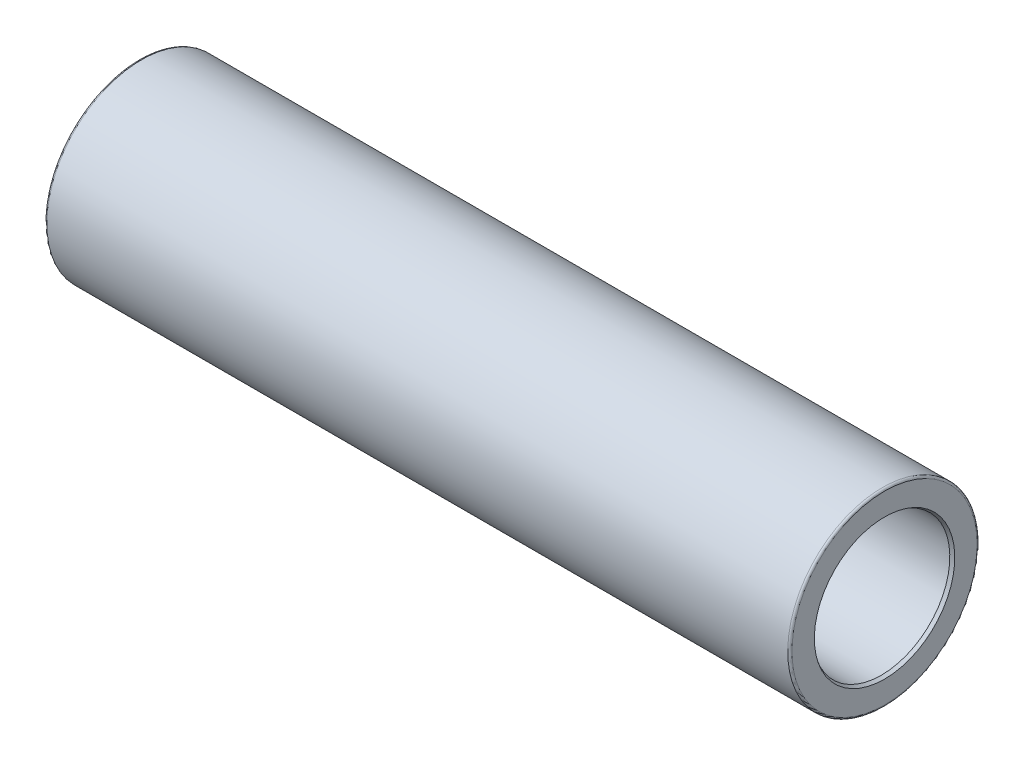
ISO-10303-21;
HEADER;
FILE_DESCRIPTION(('STEP AP214'),'2;1');
FILE_NAME('part.step','',(''),(''),'','','');
FILE_SCHEMA(('AUTOMOTIVE_DESIGN { 1 0 10303 214 1 1 1 1 }'));
ENDSEC;
DATA;
#1=APPLICATION_CONTEXT('core data for automotive mechanical design processes');
#2=APPLICATION_PROTOCOL_DEFINITION('international standard','automotive_design',2000,#1);
#3=PRODUCT_CONTEXT('',#1,'mechanical');
#4=PRODUCT('Part','Part','',(#3));
#5=PRODUCT_RELATED_PRODUCT_CATEGORY('part','',(#4));
#6=PRODUCT_DEFINITION_FORMATION('','',#4);
#7=PRODUCT_DEFINITION_CONTEXT('part definition',#1,'design');
#8=PRODUCT_DEFINITION('design','',#6,#7);
#9=PRODUCT_DEFINITION_SHAPE('','',#8);
#10=(LENGTH_UNIT() NAMED_UNIT(*) SI_UNIT(.MILLI.,.METRE.));
#11=(NAMED_UNIT(*) PLANE_ANGLE_UNIT() SI_UNIT($,.RADIAN.));
#12=(NAMED_UNIT(*) SI_UNIT($,.STERADIAN.) SOLID_ANGLE_UNIT());
#13=UNCERTAINTY_MEASURE_WITH_UNIT(LENGTH_MEASURE(1.E-05),#10,'distance_accuracy_value','');
#14=(GEOMETRIC_REPRESENTATION_CONTEXT(3) GLOBAL_UNCERTAINTY_ASSIGNED_CONTEXT((#13)) GLOBAL_UNIT_ASSIGNED_CONTEXT((#10,
#11,#12)) REPRESENTATION_CONTEXT('',''));
#15=CARTESIAN_POINT('',(0.,0.,0.));
#16=DIRECTION('',(0.,0.,1.));
#17=DIRECTION('',(1.,0.,0.));
#18=AXIS2_PLACEMENT_3D('',#15,#16,#17);
#19=CARTESIAN_POINT('',(-177.,0.,0.));
#20=DIRECTION('',(-1.,0.,0.));
#21=DIRECTION('',(0.,-1.,0.));
#22=AXIS2_PLACEMENT_3D('',#19,#20,#21);
#23=CYLINDRICAL_SURFACE('',#22,32.5);
#24=CARTESIAN_POINT('',(-120.462610505505,-2.22044604925031E-13,2.22044604925031E-13));
#25=DIRECTION('',(-1.,0.,0.));
#26=DIRECTION('',(0.,-1.,0.));
#27=AXIS2_PLACEMENT_3D('',#24,#25,#26);
#28=CIRCLE('',#27,32.5);
#29=CARTESIAN_POINT('',(-120.462610505505,-32.5000000000003,2.14828155264968E-13));
#30=VERTEX_POINT('',#29);
#31=EDGE_CURVE('E10',#30,#30,#28,.T.);
#32=ORIENTED_EDGE('',*,*,#31,.F.);
#33=EDGE_LOOP('',(#32));
#34=FACE_BOUND('',#33,.T.);
#35=CARTESIAN_POINT('',(-175.5,0.,0.));
#36=DIRECTION('',(-1.,0.,0.));
#37=DIRECTION('',(0.,-1.,0.));
#38=AXIS2_PLACEMENT_3D('',#35,#36,#37);
#39=CIRCLE('',#38,32.5);
#40=CARTESIAN_POINT('',(-175.5,-32.5,0.));
#41=VERTEX_POINT('',#40);
#42=EDGE_CURVE('E112',#41,#41,#39,.T.);
#43=ORIENTED_EDGE('',*,*,#42,.T.);
#44=EDGE_LOOP('',(#43));
#45=FACE_BOUND('',#44,.T.);
#46=ADVANCED_FACE('F39',(#34,#45),#23,.F.);
#47=CARTESIAN_POINT('',(-177.,32.4999999999999,4.44089209850063E-13));
#48=DIRECTION('',(-1.,0.,0.));
#49=DIRECTION('',(0.,-1.,0.));
#50=AXIS2_PLACEMENT_3D('',#47,#48,#49);
#51=PLANE('',#50);
#52=CARTESIAN_POINT('',(-177.,0.,0.));
#53=DIRECTION('',(-1.,0.,0.));
#54=DIRECTION('',(0.,-1.,0.));
#55=AXIS2_PLACEMENT_3D('',#52,#53,#54);
#56=CIRCLE('',#55,44.);
#57=CARTESIAN_POINT('',(-177.,-44.0000000000001,0.));
#58=VERTEX_POINT('',#57);
#59=EDGE_CURVE('E103',#58,#58,#56,.T.);
#60=ORIENTED_EDGE('',*,*,#59,.T.);
#61=EDGE_LOOP('',(#60));
#62=FACE_BOUND('',#61,.T.);
#63=CARTESIAN_POINT('',(-177.,0.,0.));
#64=DIRECTION('',(-1.,0.,0.));
#65=DIRECTION('',(0.,-1.,0.));
#66=AXIS2_PLACEMENT_3D('',#63,#64,#65);
#67=CIRCLE('',#66,33.3660254037845);
#68=CARTESIAN_POINT('',(-177.,-33.3660254037845,0.));
#69=VERTEX_POINT('',#68);
#70=EDGE_CURVE('E115',#69,#69,#67,.T.);
#71=ORIENTED_EDGE('',*,*,#70,.F.);
#72=EDGE_LOOP('',(#71));
#73=FACE_BOUND('',#72,.T.);
#74=ADVANCED_FACE('F122',(#62,#73),#51,.T.);
#75=CARTESIAN_POINT('',(-177.,0.,0.));
#76=DIRECTION('',(-1.,0.,0.));
#77=DIRECTION('',(0.,-1.,0.));
#78=AXIS2_PLACEMENT_3D('',#75,#76,#77);
#79=CYLINDRICAL_SURFACE('',#78,32.5);
#80=CARTESIAN_POINT('',(120.462610505505,-3.33066907387547E-13,2.22044604925031E-13));
#81=DIRECTION('',(-1.,0.,0.));
#82=DIRECTION('',(0.,-1.,0.));
#83=AXIS2_PLACEMENT_3D('',#80,#81,#82);
#84=CIRCLE('',#83,32.5);
#85=CARTESIAN_POINT('',(120.462610505505,-32.5000000000004,2.14828155264968E-13));
#86=VERTEX_POINT('',#85);
#87=EDGE_CURVE('E91',#86,#86,#84,.T.);
#88=ORIENTED_EDGE('',*,*,#87,.T.);
#89=EDGE_LOOP('',(#88));
#90=FACE_BOUND('',#89,.T.);
#91=CARTESIAN_POINT('',(175.5,-2.77555756156289E-13,8.88178419700125E-13));
#92=DIRECTION('',(-1.,0.,0.));
#93=DIRECTION('',(0.,-1.,0.));
#94=AXIS2_PLACEMENT_3D('',#91,#92,#93);
#95=CIRCLE('',#94,32.5000000000001);
#96=CARTESIAN_POINT('',(175.5,-32.5000000000004,8.80961970040062E-13));
#97=VERTEX_POINT('',#96);
#98=EDGE_CURVE('E106',#97,#97,#95,.T.);
#99=ORIENTED_EDGE('',*,*,#98,.F.);
#100=EDGE_LOOP('',(#99));
#101=FACE_BOUND('',#100,.T.);
#102=ADVANCED_FACE('F124',(#90,#101),#79,.F.);
#103=CARTESIAN_POINT('',(177.,32.5,1.11022302462516E-12));
#104=DIRECTION('',(-1.,0.,0.));
#105=DIRECTION('',(0.,-1.,0.));
#106=AXIS2_PLACEMENT_3D('',#103,#104,#105);
#107=PLANE('',#106);
#108=CARTESIAN_POINT('',(177.,0.,0.));
#109=DIRECTION('',(-1.,0.,0.));
#110=DIRECTION('',(0.,-1.,0.));
#111=AXIS2_PLACEMENT_3D('',#108,#109,#110);
#112=CIRCLE('',#111,44.);
#113=CARTESIAN_POINT('',(177.,-44.0000000000001,0.));
#114=VERTEX_POINT('',#113);
#115=EDGE_CURVE('E94',#114,#114,#112,.T.);
#116=ORIENTED_EDGE('',*,*,#115,.F.);
#117=EDGE_LOOP('',(#116));
#118=FACE_BOUND('',#117,.T.);
#119=CARTESIAN_POINT('',(177.,0.,1.11022302462516E-12));
#120=DIRECTION('',(-1.,0.,0.));
#121=DIRECTION('',(0.,-1.,0.));
#122=AXIS2_PLACEMENT_3D('',#119,#120,#121);
#123=CIRCLE('',#122,33.3660254037845);
#124=CARTESIAN_POINT('',(177.,-33.3660254037845,1.10281427869645E-12));
#125=VERTEX_POINT('',#124);
#126=EDGE_CURVE('E109',#125,#125,#123,.T.);
#127=ORIENTED_EDGE('',*,*,#126,.T.);
#128=EDGE_LOOP('',(#127));
#129=FACE_BOUND('',#128,.T.);
#130=ADVANCED_FACE('F131',(#118,#129),#107,.F.);
#131=CARTESIAN_POINT('',(-120.462610505505,-2.22044604925031E-13,2.22044604925031E-13));
#132=DIRECTION('',(1.,0.,0.));
#133=DIRECTION('',(0.,1.,0.));
#134=AXIS2_PLACEMENT_3D('',#131,#132,#133);
#135=CONICAL_SURFACE('',#134,32.5,0.471238898038471);
#136=CARTESIAN_POINT('',(-118.5,-2.22044604925031E-13,2.22044604925031E-13));
#137=DIRECTION('',(-1.,0.,0.));
#138=DIRECTION('',(0.,-1.,0.));
#139=AXIS2_PLACEMENT_3D('',#136,#137,#138);
#140=CIRCLE('',#139,33.5);
#141=CARTESIAN_POINT('',(-118.5,-33.5000000000003,2.14606110660043E-13));
#142=VERTEX_POINT('',#141);
#143=EDGE_CURVE('E45',#142,#142,#140,.T.);
#144=ORIENTED_EDGE('',*,*,#143,.F.);
#145=EDGE_LOOP('',(#144));
#146=FACE_BOUND('',#145,.T.);
#147=ORIENTED_EDGE('',*,*,#31,.T.);
#148=EDGE_LOOP('',(#147));
#149=FACE_BOUND('',#148,.T.);
#150=ADVANCED_FACE('F153',(#146,#149),#135,.F.);
#151=CARTESIAN_POINT('',(-177.,0.,0.));
#152=DIRECTION('',(-1.,0.,0.));
#153=DIRECTION('',(0.,-1.,0.));
#154=AXIS2_PLACEMENT_3D('',#151,#152,#153);
#155=CYLINDRICAL_SURFACE('',#154,33.5);
#156=CARTESIAN_POINT('',(-116.5,-2.22044604925031E-13,2.22044604925031E-13));
#157=DIRECTION('',(-1.,0.,0.));
#158=DIRECTION('',(0.,-1.,0.));
#159=AXIS2_PLACEMENT_3D('',#156,#157,#158);
#160=CIRCLE('',#159,33.5);
#161=CARTESIAN_POINT('',(-116.5,-33.5000000000003,2.14606110660043E-13));
#162=VERTEX_POINT('',#161);
#163=EDGE_CURVE('E49',#162,#162,#160,.T.);
#164=ORIENTED_EDGE('',*,*,#163,.F.);
#165=EDGE_LOOP('',(#164));
#166=FACE_BOUND('',#165,.T.);
#167=ORIENTED_EDGE('',*,*,#143,.T.);
#168=EDGE_LOOP('',(#167));
#169=FACE_BOUND('',#168,.T.);
#170=ADVANCED_FACE('F206',(#166,#169),#155,.F.);
#171=CARTESIAN_POINT('',(-116.5,33.4999999999996,2.22044604925031E-13));
#172=DIRECTION('',(1.,0.,0.));
#173=DIRECTION('',(0.,1.,0.));
#174=AXIS2_PLACEMENT_3D('',#171,#172,#173);
#175=PLANE('',#174);
#176=CARTESIAN_POINT('',(-116.5,-2.22044604925031E-13,2.22044604925031E-13));
#177=DIRECTION('',(-1.,0.,0.));
#178=DIRECTION('',(0.,-1.,0.));
#179=AXIS2_PLACEMENT_3D('',#176,#177,#178);
#180=CIRCLE('',#179,31.5);
#181=CARTESIAN_POINT('',(-116.5,-31.5000000000003,2.15050199869893E-13));
#182=VERTEX_POINT('',#181);
#183=EDGE_CURVE('E53',#182,#182,#180,.T.);
#184=ORIENTED_EDGE('',*,*,#183,.F.);
#185=EDGE_LOOP('',(#184));
#186=FACE_BOUND('',#185,.T.);
#187=ORIENTED_EDGE('',*,*,#163,.T.);
#188=EDGE_LOOP('',(#187));
#189=FACE_BOUND('',#188,.T.);
#190=ADVANCED_FACE('F202',(#186,#189),#175,.F.);
#191=CARTESIAN_POINT('',(-177.,0.,0.));
#192=DIRECTION('',(-1.,0.,0.));
#193=DIRECTION('',(0.,-1.,0.));
#194=AXIS2_PLACEMENT_3D('',#191,#192,#193);
#195=CYLINDRICAL_SURFACE('',#194,31.5);
#196=CARTESIAN_POINT('',(-107.176326980708,-1.66533453693773E-13,2.22044604925031E-13));
#197=DIRECTION('',(-1.,0.,0.));
#198=DIRECTION('',(0.,-1.,0.));
#199=AXIS2_PLACEMENT_3D('',#196,#197,#198);
#200=CIRCLE('',#199,31.5);
#201=CARTESIAN_POINT('',(-107.176326980708,-31.5000000000002,2.15050199869893E-13));
#202=VERTEX_POINT('',#201);
#203=EDGE_CURVE('E58',#202,#202,#200,.T.);
#204=ORIENTED_EDGE('',*,*,#203,.F.);
#205=EDGE_LOOP('',(#204));
#206=FACE_BOUND('',#205,.T.);
#207=ORIENTED_EDGE('',*,*,#183,.T.);
#208=EDGE_LOOP('',(#207));
#209=FACE_BOUND('',#208,.T.);
#210=ADVANCED_FACE('F198',(#206,#209),#195,.F.);
#211=CARTESIAN_POINT('',(-107.176326980708,-1.66533453693773E-13,2.22044604925031E-13));
#212=DIRECTION('',(-1.,0.,0.));
#213=DIRECTION('',(0.,-1.,0.));
#214=AXIS2_PLACEMENT_3D('',#211,#212,#213);
#215=TOROIDAL_SURFACE('',#214,32.5,1.);
#216=CARTESIAN_POINT('',(-106.834306837383,0.,0.));
#217=DIRECTION('',(-1.,0.,0.));
#218=DIRECTION('',(0.,-1.,0.));
#219=AXIS2_PLACEMENT_3D('',#216,#217,#218);
#220=CIRCLE('',#219,31.5603073792141);
#221=CARTESIAN_POINT('',(-106.834306837383,-31.5603073792141,0.));
#222=VERTEX_POINT('',#221);
#223=EDGE_CURVE('E61',#222,#222,#220,.T.);
#224=ORIENTED_EDGE('',*,*,#223,.F.);
#225=EDGE_LOOP('',(#224));
#226=FACE_BOUND('',#225,.T.);
#227=ORIENTED_EDGE('',*,*,#203,.T.);
#228=EDGE_LOOP('',(#227));
#229=FACE_BOUND('',#228,.T.);
#230=ADVANCED_FACE('F194',(#226,#229),#215,.T.);
#231=CARTESIAN_POINT('',(-106.834306837383,0.,0.));
#232=DIRECTION('',(1.,0.,0.));
#233=DIRECTION('',(0.,1.,0.));
#234=AXIS2_PLACEMENT_3D('',#231,#232,#233);
#235=CONICAL_SURFACE('',#234,31.5603073792141,0.349065850398866);
#236=CARTESIAN_POINT('',(-100.296999613981,0.,0.));
#237=DIRECTION('',(-1.,0.,0.));
#238=DIRECTION('',(0.,-1.,0.));
#239=AXIS2_PLACEMENT_3D('',#236,#237,#238);
#240=CIRCLE('',#239,33.9396926207859);
#241=CARTESIAN_POINT('',(-100.296999613981,-33.9396926207859,0.));
#242=VERTEX_POINT('',#241);
#243=EDGE_CURVE('E64',#242,#242,#240,.T.);
#244=ORIENTED_EDGE('',*,*,#243,.F.);
#245=EDGE_LOOP('',(#244));
#246=FACE_BOUND('',#245,.T.);
#247=ORIENTED_EDGE('',*,*,#223,.T.);
#248=EDGE_LOOP('',(#247));
#249=FACE_BOUND('',#248,.T.);
#250=ADVANCED_FACE('F190',(#246,#249),#235,.F.);
#251=CARTESIAN_POINT('',(-99.9549794706549,-2.22044604925031E-13,2.22044604925031E-13));
#252=DIRECTION('',(-1.,0.,0.));
#253=DIRECTION('',(0.,-1.,0.));
#254=AXIS2_PLACEMENT_3D('',#251,#252,#253);
#255=TOROIDAL_SURFACE('',#254,33.,0.999999999999997);
#256=ORIENTED_EDGE('',*,*,#243,.T.);
#257=EDGE_LOOP('',(#256));
#258=FACE_BOUND('',#257,.T.);
#259=CARTESIAN_POINT('',(-99.9549794706549,-2.22044604925031E-13,2.22044604925031E-13));
#260=DIRECTION('',(-1.,0.,0.));
#261=DIRECTION('',(0.,-1.,0.));
#262=AXIS2_PLACEMENT_3D('',#259,#260,#261);
#263=CIRCLE('',#262,34.);
#264=CARTESIAN_POINT('',(-99.9549794706549,-34.0000000000003,2.1449508835758E-13));
#265=VERTEX_POINT('',#264);
#266=EDGE_CURVE('E67',#265,#265,#263,.T.);
#267=ORIENTED_EDGE('',*,*,#266,.F.);
#268=EDGE_LOOP('',(#267));
#269=FACE_BOUND('',#268,.T.);
#270=ADVANCED_FACE('F186',(#258,#269),#255,.F.);
#271=CARTESIAN_POINT('',(-177.,0.,0.));
#272=DIRECTION('',(-1.,0.,0.));
#273=DIRECTION('',(0.,-1.,0.));
#274=AXIS2_PLACEMENT_3D('',#271,#272,#273);
#275=CYLINDRICAL_SURFACE('',#274,34.);
#276=CARTESIAN_POINT('',(99.9549794706549,0.,0.));
#277=DIRECTION('',(-1.,0.,0.));
#278=DIRECTION('',(0.,-1.,0.));
#279=AXIS2_PLACEMENT_3D('',#276,#277,#278);
#280=CIRCLE('',#279,34.);
#281=CARTESIAN_POINT('',(99.9549794706549,-34.,0.));
#282=VERTEX_POINT('',#281);
#283=EDGE_CURVE('E70',#282,#282,#280,.T.);
#284=ORIENTED_EDGE('',*,*,#283,.F.);
#285=EDGE_LOOP('',(#284));
#286=FACE_BOUND('',#285,.T.);
#287=ORIENTED_EDGE('',*,*,#266,.T.);
#288=EDGE_LOOP('',(#287));
#289=FACE_BOUND('',#288,.T.);
#290=ADVANCED_FACE('F182',(#286,#289),#275,.F.);
#291=CARTESIAN_POINT('',(99.9549794706552,0.,0.));
#292=DIRECTION('',(-1.,0.,0.));
#293=DIRECTION('',(0.,-1.,0.));
#294=AXIS2_PLACEMENT_3D('',#291,#292,#293);
#295=TOROIDAL_SURFACE('',#294,33.,0.999999999999997);
#296=CARTESIAN_POINT('',(100.296999613981,-3.33066907387547E-13,2.22044604925031E-13));
#297=DIRECTION('',(-1.,0.,0.));
#298=DIRECTION('',(0.,-1.,0.));
#299=AXIS2_PLACEMENT_3D('',#296,#297,#298);
#300=CIRCLE('',#299,33.9396926207859);
#301=CARTESIAN_POINT('',(100.296999613981,-33.9396926207863,2.14508479285772E-13));
#302=VERTEX_POINT('',#301);
#303=EDGE_CURVE('E73',#302,#302,#300,.T.);
#304=ORIENTED_EDGE('',*,*,#303,.F.);
#305=EDGE_LOOP('',(#304));
#306=FACE_BOUND('',#305,.T.);
#307=ORIENTED_EDGE('',*,*,#283,.T.);
#308=EDGE_LOOP('',(#307));
#309=FACE_BOUND('',#308,.T.);
#310=ADVANCED_FACE('F178',(#306,#309),#295,.F.);
#311=CARTESIAN_POINT('',(106.834306837383,-3.33066907387547E-13,2.22044604925031E-13));
#312=DIRECTION('',(-1.,0.,0.));
#313=DIRECTION('',(0.,-1.,0.));
#314=AXIS2_PLACEMENT_3D('',#311,#312,#313);
#315=CONICAL_SURFACE('',#314,31.5603073792141,0.349065850398867);
#316=ORIENTED_EDGE('',*,*,#303,.T.);
#317=EDGE_LOOP('',(#316));
#318=FACE_BOUND('',#317,.T.);
#319=CARTESIAN_POINT('',(106.834306837383,-3.33066907387547E-13,2.22044604925031E-13));
#320=DIRECTION('',(-1.,0.,0.));
#321=DIRECTION('',(0.,-1.,0.));
#322=AXIS2_PLACEMENT_3D('',#319,#320,#321);
#323=CIRCLE('',#322,31.5603073792141);
#324=CARTESIAN_POINT('',(106.834306837383,-31.5603073792145,2.15036808941701E-13));
#325=VERTEX_POINT('',#324);
#326=EDGE_CURVE('E76',#325,#325,#323,.T.);
#327=ORIENTED_EDGE('',*,*,#326,.F.);
#328=EDGE_LOOP('',(#327));
#329=FACE_BOUND('',#328,.T.);
#330=ADVANCED_FACE('F174',(#318,#329),#315,.F.);
#331=CARTESIAN_POINT('',(107.176326980709,-3.33066907387547E-13,2.22044604925031E-13));
#332=DIRECTION('',(-1.,0.,0.));
#333=DIRECTION('',(0.,-1.,0.));
#334=AXIS2_PLACEMENT_3D('',#331,#332,#333);
#335=TOROIDAL_SURFACE('',#334,32.5,1.);
#336=ORIENTED_EDGE('',*,*,#326,.T.);
#337=EDGE_LOOP('',(#336));
#338=FACE_BOUND('',#337,.T.);
#339=CARTESIAN_POINT('',(107.176326980709,-3.33066907387547E-13,2.22044604925031E-13));
#340=DIRECTION('',(-1.,0.,0.));
#341=DIRECTION('',(0.,-1.,0.));
#342=AXIS2_PLACEMENT_3D('',#339,#340,#341);
#343=CIRCLE('',#342,31.5);
#344=CARTESIAN_POINT('',(107.176326980709,-31.5000000000004,2.15050199869893E-13));
#345=VERTEX_POINT('',#344);
#346=EDGE_CURVE('E79',#345,#345,#343,.T.);
#347=ORIENTED_EDGE('',*,*,#346,.F.);
#348=EDGE_LOOP('',(#347));
#349=FACE_BOUND('',#348,.T.);
#350=ADVANCED_FACE('F170',(#338,#349),#335,.T.);
#351=CARTESIAN_POINT('',(-177.,0.,0.));
#352=DIRECTION('',(-1.,0.,0.));
#353=DIRECTION('',(0.,-1.,0.));
#354=AXIS2_PLACEMENT_3D('',#351,#352,#353);
#355=CYLINDRICAL_SURFACE('',#354,31.5);
#356=CARTESIAN_POINT('',(116.5,-3.33066907387547E-13,2.22044604925031E-13));
#357=DIRECTION('',(-1.,0.,0.));
#358=DIRECTION('',(0.,-1.,0.));
#359=AXIS2_PLACEMENT_3D('',#356,#357,#358);
#360=CIRCLE('',#359,31.5);
#361=CARTESIAN_POINT('',(116.5,-31.5000000000004,2.15050199869893E-13));
#362=VERTEX_POINT('',#361);
#363=EDGE_CURVE('E82',#362,#362,#360,.T.);
#364=ORIENTED_EDGE('',*,*,#363,.F.);
#365=EDGE_LOOP('',(#364));
#366=FACE_BOUND('',#365,.T.);
#367=ORIENTED_EDGE('',*,*,#346,.T.);
#368=EDGE_LOOP('',(#367));
#369=FACE_BOUND('',#368,.T.);
#370=ADVANCED_FACE('F166',(#366,#369),#355,.F.);
#371=CARTESIAN_POINT('',(116.5,33.5,0.));
#372=DIRECTION('',(1.,0.,0.));
#373=DIRECTION('',(0.,1.,0.));
#374=AXIS2_PLACEMENT_3D('',#371,#372,#373);
#375=PLANE('',#374);
#376=ORIENTED_EDGE('',*,*,#363,.T.);
#377=EDGE_LOOP('',(#376));
#378=FACE_BOUND('',#377,.T.);
#379=CARTESIAN_POINT('',(116.5,-3.33066907387547E-13,2.22044604925031E-13));
#380=DIRECTION('',(-1.,0.,0.));
#381=DIRECTION('',(0.,-1.,0.));
#382=AXIS2_PLACEMENT_3D('',#379,#380,#381);
#383=CIRCLE('',#382,33.5);
#384=CARTESIAN_POINT('',(116.5,-33.5000000000004,2.14606110660043E-13));
#385=VERTEX_POINT('',#384);
#386=EDGE_CURVE('E85',#385,#385,#383,.T.);
#387=ORIENTED_EDGE('',*,*,#386,.F.);
#388=EDGE_LOOP('',(#387));
#389=FACE_BOUND('',#388,.T.);
#390=ADVANCED_FACE('F162',(#378,#389),#375,.T.);
#391=CARTESIAN_POINT('',(-177.,0.,0.));
#392=DIRECTION('',(-1.,0.,0.));
#393=DIRECTION('',(0.,-1.,0.));
#394=AXIS2_PLACEMENT_3D('',#391,#392,#393);
#395=CYLINDRICAL_SURFACE('',#394,33.5);
#396=ORIENTED_EDGE('',*,*,#386,.T.);
#397=EDGE_LOOP('',(#396));
#398=FACE_BOUND('',#397,.T.);
#399=CARTESIAN_POINT('',(118.5,0.,0.));
#400=DIRECTION('',(-1.,0.,0.));
#401=DIRECTION('',(0.,-1.,0.));
#402=AXIS2_PLACEMENT_3D('',#399,#400,#401);
#403=CIRCLE('',#402,33.5);
#404=CARTESIAN_POINT('',(118.5,-33.5,0.));
#405=VERTEX_POINT('',#404);
#406=EDGE_CURVE('E88',#405,#405,#403,.T.);
#407=ORIENTED_EDGE('',*,*,#406,.F.);
#408=EDGE_LOOP('',(#407));
#409=FACE_BOUND('',#408,.T.);
#410=ADVANCED_FACE('F158',(#398,#409),#395,.F.);
#411=CARTESIAN_POINT('',(120.462610505505,-3.33066907387547E-13,2.22044604925031E-13));
#412=DIRECTION('',(-1.,0.,0.));
#413=DIRECTION('',(0.,-1.,0.));
#414=AXIS2_PLACEMENT_3D('',#411,#412,#413);
#415=CONICAL_SURFACE('',#414,32.5,0.471238898038466);
#416=ORIENTED_EDGE('',*,*,#406,.T.);
#417=EDGE_LOOP('',(#416));
#418=FACE_BOUND('',#417,.T.);
#419=ORIENTED_EDGE('',*,*,#87,.F.);
#420=EDGE_LOOP('',(#419));
#421=FACE_BOUND('',#420,.T.);
#422=ADVANCED_FACE('F150',(#418,#421),#415,.F.);
#423=CARTESIAN_POINT('',(176.,-3.88578058618805E-13,6.66133814775094E-13));
#424=DIRECTION('',(-1.,0.,0.));
#425=DIRECTION('',(0.,-1.,0.));
#426=AXIS2_PLACEMENT_3D('',#423,#424,#425);
#427=TOROIDAL_SURFACE('',#426,44.,1.);
#428=ORIENTED_EDGE('',*,*,#115,.T.);
#429=EDGE_LOOP('',(#428));
#430=FACE_BOUND('',#429,.T.);
#431=CARTESIAN_POINT('',(176.,-3.88578058618805E-13,6.66133814775094E-13));
#432=DIRECTION('',(-1.,0.,0.));
#433=DIRECTION('',(0.,-1.,0.));
#434=AXIS2_PLACEMENT_3D('',#431,#432,#433);
#435=CIRCLE('',#434,45.);
#436=CARTESIAN_POINT('',(176.,-45.0000000000005,6.56141807553468E-13));
#437=VERTEX_POINT('',#436);
#438=EDGE_CURVE('E97',#437,#437,#435,.T.);
#439=ORIENTED_EDGE('',*,*,#438,.F.);
#440=EDGE_LOOP('',(#439));
#441=FACE_BOUND('',#440,.T.);
#442=ADVANCED_FACE('F146',(#430,#441),#427,.T.);
#443=CARTESIAN_POINT('',(-177.,0.,0.));
#444=DIRECTION('',(-1.,0.,0.));
#445=DIRECTION('',(0.,-1.,0.));
#446=AXIS2_PLACEMENT_3D('',#443,#444,#445);
#447=CYLINDRICAL_SURFACE('',#446,45.);
#448=ORIENTED_EDGE('',*,*,#438,.T.);
#449=EDGE_LOOP('',(#448));
#450=FACE_BOUND('',#449,.T.);
#451=CARTESIAN_POINT('',(-176.,-2.22044604925031E-13,2.22044604925031E-13));
#452=DIRECTION('',(-1.,0.,0.));
#453=DIRECTION('',(0.,-1.,0.));
#454=AXIS2_PLACEMENT_3D('',#451,#452,#453);
#455=CIRCLE('',#454,45.);
#456=CARTESIAN_POINT('',(-176.,-45.0000000000003,2.12052597703405E-13));
#457=VERTEX_POINT('',#456);
#458=EDGE_CURVE('E100',#457,#457,#455,.T.);
#459=ORIENTED_EDGE('',*,*,#458,.F.);
#460=EDGE_LOOP('',(#459));
#461=FACE_BOUND('',#460,.T.);
#462=ADVANCED_FACE('F142',(#450,#461),#447,.T.);
#463=CARTESIAN_POINT('',(-176.,-2.22044604925031E-13,2.22044604925031E-13));
#464=DIRECTION('',(-1.,0.,0.));
#465=DIRECTION('',(0.,-1.,0.));
#466=AXIS2_PLACEMENT_3D('',#463,#464,#465);
#467=TOROIDAL_SURFACE('',#466,44.,1.);
#468=ORIENTED_EDGE('',*,*,#59,.F.);
#469=EDGE_LOOP('',(#468));
#470=FACE_BOUND('',#469,.T.);
#471=ORIENTED_EDGE('',*,*,#458,.T.);
#472=EDGE_LOOP('',(#471));
#473=FACE_BOUND('',#472,.T.);
#474=ADVANCED_FACE('F139',(#470,#473),#467,.T.);
#475=CARTESIAN_POINT('',(177.,0.,1.11022302462516E-12));
#476=DIRECTION('',(1.,0.,0.));
#477=DIRECTION('',(0.,1.,0.));
#478=AXIS2_PLACEMENT_3D('',#475,#476,#477);
#479=CONICAL_SURFACE('',#478,33.3660254037845,0.523598775598294);
#480=ORIENTED_EDGE('',*,*,#98,.T.);
#481=EDGE_LOOP('',(#480));
#482=FACE_BOUND('',#481,.T.);
#483=ORIENTED_EDGE('',*,*,#126,.F.);
#484=EDGE_LOOP('',(#483));
#485=FACE_BOUND('',#484,.T.);
#486=ADVANCED_FACE('F137',(#482,#485),#479,.F.);
#487=CARTESIAN_POINT('',(-175.5,0.,0.));
#488=DIRECTION('',(-1.,0.,0.));
#489=DIRECTION('',(0.,-1.,0.));
#490=AXIS2_PLACEMENT_3D('',#487,#488,#489);
#491=CONICAL_SURFACE('',#490,32.5,0.523598775598294);
#492=ORIENTED_EDGE('',*,*,#70,.T.);
#493=EDGE_LOOP('',(#492));
#494=FACE_BOUND('',#493,.T.);
#495=ORIENTED_EDGE('',*,*,#42,.F.);
#496=EDGE_LOOP('',(#495));
#497=FACE_BOUND('',#496,.T.);
#498=ADVANCED_FACE('F119',(#494,#497),#491,.F.);
#499=CLOSED_SHELL('',(#46,#74,#102,#130,#150,#170,#190,#210,#230,#250,#270,#290,#310,#330,#350,
#370,#390,#410,#422,#442,#462,#474,#486,#498));
#500=MANIFOLD_SOLID_BREP('B2',#499);
#501=ADVANCED_BREP_SHAPE_REPRESENTATION('',(#18,#500),#14);
#502=SHAPE_DEFINITION_REPRESENTATION(#9,#501);
ENDSEC;
END-ISO-10303-21;
